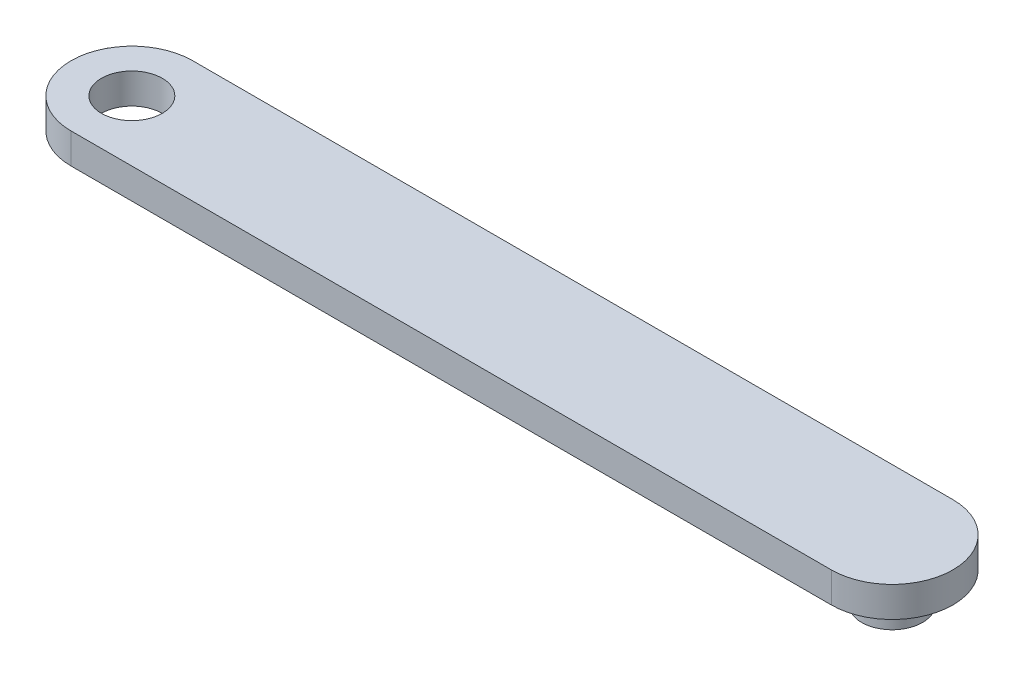
ISO-10303-21;
HEADER;
FILE_DESCRIPTION(('STEP AP214'),'2;1');
FILE_NAME('part.step','',(''),(''),'','','');
FILE_SCHEMA(('AUTOMOTIVE_DESIGN { 1 0 10303 214 1 1 1 1 }'));
ENDSEC;
DATA;
#1=APPLICATION_CONTEXT('core data for automotive mechanical design processes');
#2=APPLICATION_PROTOCOL_DEFINITION('international standard','automotive_design',2000,#1);
#3=PRODUCT_CONTEXT('',#1,'mechanical');
#4=PRODUCT('Part','Part','',(#3));
#5=PRODUCT_RELATED_PRODUCT_CATEGORY('part','',(#4));
#6=PRODUCT_DEFINITION_FORMATION('','',#4);
#7=PRODUCT_DEFINITION_CONTEXT('part definition',#1,'design');
#8=PRODUCT_DEFINITION('design','',#6,#7);
#9=PRODUCT_DEFINITION_SHAPE('','',#8);
#10=(LENGTH_UNIT() NAMED_UNIT(*) SI_UNIT(.MILLI.,.METRE.));
#11=(NAMED_UNIT(*) PLANE_ANGLE_UNIT() SI_UNIT($,.RADIAN.));
#12=(NAMED_UNIT(*) SI_UNIT($,.STERADIAN.) SOLID_ANGLE_UNIT());
#13=UNCERTAINTY_MEASURE_WITH_UNIT(LENGTH_MEASURE(1.E-05),#10,'distance_accuracy_value','');
#14=(GEOMETRIC_REPRESENTATION_CONTEXT(3) GLOBAL_UNCERTAINTY_ASSIGNED_CONTEXT((#13)) GLOBAL_UNIT_ASSIGNED_CONTEXT((#10,
#11,#12)) REPRESENTATION_CONTEXT('',''));
#15=CARTESIAN_POINT('',(0.,0.,0.));
#16=DIRECTION('',(0.,0.,1.));
#17=DIRECTION('',(1.,0.,0.));
#18=AXIS2_PLACEMENT_3D('',#15,#16,#17);
#19=CARTESIAN_POINT('',(0.,1.,2.));
#20=DIRECTION('',(0.,0.,-1.));
#21=DIRECTION('',(-1.,0.,0.));
#22=AXIS2_PLACEMENT_3D('',#19,#20,#21);
#23=PLANE('',#22);
#24=DIRECTION('',(1.,0.,0.));
#25=VECTOR('',#24,1.);
#26=CARTESIAN_POINT('',(0.,0.,2.));
#27=LINE('',#26,#25);
#28=CARTESIAN_POINT('',(-12.5,0.,2.));
#29=VERTEX_POINT('',#28);
#30=CARTESIAN_POINT('',(12.5,0.,2.));
#31=VERTEX_POINT('',#30);
#32=EDGE_CURVE('E116',#29,#31,#27,.T.);
#33=ORIENTED_EDGE('',*,*,#32,.T.);
#34=DIRECTION('',(0.,-1.,0.));
#35=VECTOR('',#34,1.);
#36=CARTESIAN_POINT('',(12.5,1.,2.));
#37=LINE('',#36,#35);
#38=CARTESIAN_POINT('',(12.5,1.,2.));
#39=VERTEX_POINT('',#38);
#40=EDGE_CURVE('E51',#39,#31,#37,.T.);
#41=ORIENTED_EDGE('',*,*,#40,.F.);
#42=DIRECTION('',(1.,0.,0.));
#43=VECTOR('',#42,1.);
#44=CARTESIAN_POINT('',(0.,1.,2.));
#45=LINE('',#44,#43);
#46=CARTESIAN_POINT('',(-12.5,1.,2.));
#47=VERTEX_POINT('',#46);
#48=EDGE_CURVE('E91',#47,#39,#45,.T.);
#49=ORIENTED_EDGE('',*,*,#48,.F.);
#50=DIRECTION('',(0.,-1.,0.));
#51=VECTOR('',#50,1.);
#52=CARTESIAN_POINT('',(-12.5,1.,2.));
#53=LINE('',#52,#51);
#54=EDGE_CURVE('E108',#47,#29,#53,.T.);
#55=ORIENTED_EDGE('',*,*,#54,.T.);
#56=EDGE_LOOP('',(#33,#41,#49,#55));
#57=FACE_BOUND('',#56,.T.);
#58=ADVANCED_FACE('F41',(#57),#23,.F.);
#59=CARTESIAN_POINT('',(12.5,1.,0.));
#60=DIRECTION('',(0.,-1.,0.));
#61=DIRECTION('',(0.,0.,-1.));
#62=AXIS2_PLACEMENT_3D('',#59,#60,#61);
#63=CYLINDRICAL_SURFACE('',#62,2.);
#64=CARTESIAN_POINT('',(12.5,0.,0.));
#65=DIRECTION('',(0.,1.,0.));
#66=DIRECTION('',(0.,0.,1.));
#67=AXIS2_PLACEMENT_3D('',#64,#65,#66);
#68=CIRCLE('',#67,2.);
#69=CARTESIAN_POINT('',(12.5,0.,-2.));
#70=VERTEX_POINT('',#69);
#71=EDGE_CURVE('E98',#31,#70,#68,.T.);
#72=ORIENTED_EDGE('',*,*,#71,.T.);
#73=DIRECTION('',(0.,-1.,0.));
#74=VECTOR('',#73,1.);
#75=CARTESIAN_POINT('',(12.5,1.,-2.));
#76=LINE('',#75,#74);
#77=CARTESIAN_POINT('',(12.5,1.,-2.));
#78=VERTEX_POINT('',#77);
#79=EDGE_CURVE('E96',#78,#70,#76,.T.);
#80=ORIENTED_EDGE('',*,*,#79,.F.);
#81=CARTESIAN_POINT('',(12.5,1.,0.));
#82=DIRECTION('',(0.,1.,0.));
#83=DIRECTION('',(0.,0.,1.));
#84=AXIS2_PLACEMENT_3D('',#81,#82,#83);
#85=CIRCLE('',#84,2.);
#86=EDGE_CURVE('E86',#39,#78,#85,.T.);
#87=ORIENTED_EDGE('',*,*,#86,.F.);
#88=ORIENTED_EDGE('',*,*,#40,.T.);
#89=EDGE_LOOP('',(#72,#80,#87,#88));
#90=FACE_BOUND('',#89,.T.);
#91=ADVANCED_FACE('F97',(#90),#63,.T.);
#92=CARTESIAN_POINT('',(0.,1.,-2.));
#93=DIRECTION('',(0.,0.,-1.));
#94=DIRECTION('',(-1.,0.,0.));
#95=AXIS2_PLACEMENT_3D('',#92,#93,#94);
#96=PLANE('',#95);
#97=DIRECTION('',(1.,0.,0.));
#98=VECTOR('',#97,1.);
#99=CARTESIAN_POINT('',(0.,0.,-2.));
#100=LINE('',#99,#98);
#101=CARTESIAN_POINT('',(-12.5,0.,-2.));
#102=VERTEX_POINT('',#101);
#103=EDGE_CURVE('E123',#102,#70,#100,.T.);
#104=ORIENTED_EDGE('',*,*,#103,.F.);
#105=DIRECTION('',(0.,-1.,0.));
#106=VECTOR('',#105,1.);
#107=CARTESIAN_POINT('',(-12.5,1.,-2.));
#108=LINE('',#107,#106);
#109=CARTESIAN_POINT('',(-12.5,1.,-2.));
#110=VERTEX_POINT('',#109);
#111=EDGE_CURVE('E75',#110,#102,#108,.T.);
#112=ORIENTED_EDGE('',*,*,#111,.F.);
#113=DIRECTION('',(1.,0.,0.));
#114=VECTOR('',#113,1.);
#115=CARTESIAN_POINT('',(0.,1.,-2.));
#116=LINE('',#115,#114);
#117=EDGE_CURVE('E89',#110,#78,#116,.T.);
#118=ORIENTED_EDGE('',*,*,#117,.T.);
#119=ORIENTED_EDGE('',*,*,#79,.T.);
#120=EDGE_LOOP('',(#104,#112,#118,#119));
#121=FACE_BOUND('',#120,.T.);
#122=ADVANCED_FACE('F104',(#121),#96,.T.);
#123=CARTESIAN_POINT('',(-12.5,1.,0.));
#124=DIRECTION('',(0.,-1.,0.));
#125=DIRECTION('',(0.,0.,-1.));
#126=AXIS2_PLACEMENT_3D('',#123,#124,#125);
#127=CYLINDRICAL_SURFACE('',#126,1.);
#128=CARTESIAN_POINT('',(-12.5,1.,0.));
#129=DIRECTION('',(0.,1.,0.));
#130=DIRECTION('',(0.,0.,1.));
#131=AXIS2_PLACEMENT_3D('',#128,#129,#130);
#132=CIRCLE('',#131,1.);
#133=CARTESIAN_POINT('',(-12.5,1.,1.));
#134=VERTEX_POINT('',#133);
#135=EDGE_CURVE('E128',#134,#134,#132,.T.);
#136=ORIENTED_EDGE('',*,*,#135,.T.);
#137=EDGE_LOOP('',(#136));
#138=FACE_BOUND('',#137,.T.);
#139=CARTESIAN_POINT('',(-12.5,0.,0.));
#140=DIRECTION('',(0.,1.,0.));
#141=DIRECTION('',(0.,0.,1.));
#142=AXIS2_PLACEMENT_3D('',#139,#140,#141);
#143=CIRCLE('',#142,1.);
#144=CARTESIAN_POINT('',(-12.5,0.,1.));
#145=VERTEX_POINT('',#144);
#146=EDGE_CURVE('E112',#145,#145,#143,.T.);
#147=ORIENTED_EDGE('',*,*,#146,.F.);
#148=EDGE_LOOP('',(#147));
#149=FACE_BOUND('',#148,.T.);
#150=ADVANCED_FACE('F43',(#138,#149),#127,.F.);
#151=CARTESIAN_POINT('',(-12.5,1.,0.));
#152=DIRECTION('',(0.,-1.,0.));
#153=DIRECTION('',(0.,0.,-1.));
#154=AXIS2_PLACEMENT_3D('',#151,#152,#153);
#155=CYLINDRICAL_SURFACE('',#154,2.);
#156=CARTESIAN_POINT('',(-12.5,0.,0.));
#157=DIRECTION('',(0.,1.,0.));
#158=DIRECTION('',(0.,0.,1.));
#159=AXIS2_PLACEMENT_3D('',#156,#157,#158);
#160=CIRCLE('',#159,2.);
#161=EDGE_CURVE('E78',#102,#29,#160,.T.);
#162=ORIENTED_EDGE('',*,*,#161,.T.);
#163=ORIENTED_EDGE('',*,*,#54,.F.);
#164=CARTESIAN_POINT('',(-12.5,1.,0.));
#165=DIRECTION('',(0.,1.,0.));
#166=DIRECTION('',(0.,0.,1.));
#167=AXIS2_PLACEMENT_3D('',#164,#165,#166);
#168=CIRCLE('',#167,2.);
#169=EDGE_CURVE('E59',#110,#47,#168,.T.);
#170=ORIENTED_EDGE('',*,*,#169,.F.);
#171=ORIENTED_EDGE('',*,*,#111,.T.);
#172=EDGE_LOOP('',(#162,#163,#170,#171));
#173=FACE_BOUND('',#172,.T.);
#174=ADVANCED_FACE('F148',(#173),#155,.T.);
#175=CARTESIAN_POINT('',(0.,1.,0.));
#176=DIRECTION('',(0.,1.,0.));
#177=DIRECTION('',(0.,0.,1.));
#178=AXIS2_PLACEMENT_3D('',#175,#176,#177);
#179=PLANE('',#178);
#180=ORIENTED_EDGE('',*,*,#135,.F.);
#181=EDGE_LOOP('',(#180));
#182=FACE_BOUND('',#181,.T.);
#183=ORIENTED_EDGE('',*,*,#48,.T.);
#184=ORIENTED_EDGE('',*,*,#86,.T.);
#185=ORIENTED_EDGE('',*,*,#117,.F.);
#186=ORIENTED_EDGE('',*,*,#169,.T.);
#187=EDGE_LOOP('',(#183,#184,#185,#186));
#188=FACE_BOUND('',#187,.T.);
#189=ADVANCED_FACE('F87',(#182,#188),#179,.T.);
#190=CARTESIAN_POINT('',(0.,0.,0.));
#191=DIRECTION('',(0.,1.,0.));
#192=DIRECTION('',(0.,0.,1.));
#193=AXIS2_PLACEMENT_3D('',#190,#191,#192);
#194=PLANE('',#193);
#195=CARTESIAN_POINT('',(12.5,0.,0.));
#196=DIRECTION('',(0.,1.,0.));
#197=DIRECTION('',(0.,0.,1.));
#198=AXIS2_PLACEMENT_3D('',#195,#196,#197);
#199=CIRCLE('',#198,1.);
#200=CARTESIAN_POINT('',(12.5,0.,1.));
#201=VERTEX_POINT('',#200);
#202=EDGE_CURVE('E11',#201,#201,#199,.F.);
#203=ORIENTED_EDGE('',*,*,#202,.F.);
#204=EDGE_LOOP('',(#203));
#205=FACE_BOUND('',#204,.T.);
#206=ORIENTED_EDGE('',*,*,#146,.T.);
#207=EDGE_LOOP('',(#206));
#208=FACE_BOUND('',#207,.T.);
#209=ORIENTED_EDGE('',*,*,#32,.F.);
#210=ORIENTED_EDGE('',*,*,#161,.F.);
#211=ORIENTED_EDGE('',*,*,#103,.T.);
#212=ORIENTED_EDGE('',*,*,#71,.F.);
#213=EDGE_LOOP('',(#209,#210,#211,#212));
#214=FACE_BOUND('',#213,.T.);
#215=ADVANCED_FACE('F136',(#205,#208,#214),#194,.F.);
#216=CARTESIAN_POINT('',(12.5,-1.,0.));
#217=DIRECTION('',(0.,1.,0.));
#218=DIRECTION('',(0.,0.,1.));
#219=AXIS2_PLACEMENT_3D('',#216,#217,#218);
#220=CYLINDRICAL_SURFACE('',#219,1.);
#221=CARTESIAN_POINT('',(12.5,-1.,0.));
#222=DIRECTION('',(0.,-1.,0.));
#223=DIRECTION('',(0.,0.,-1.));
#224=AXIS2_PLACEMENT_3D('',#221,#222,#223);
#225=CIRCLE('',#224,1.);
#226=CARTESIAN_POINT('',(12.5,-1.,-1.));
#227=VERTEX_POINT('',#226);
#228=EDGE_CURVE('E117',#227,#227,#225,.T.);
#229=ORIENTED_EDGE('',*,*,#228,.F.);
#230=EDGE_LOOP('',(#229));
#231=FACE_BOUND('',#230,.T.);
#232=ORIENTED_EDGE('',*,*,#202,.T.);
#233=EDGE_LOOP('',(#232));
#234=FACE_BOUND('',#233,.T.);
#235=ADVANCED_FACE('F138',(#231,#234),#220,.T.);
#236=CARTESIAN_POINT('',(12.5,-1.,0.));
#237=DIRECTION('',(0.,-1.,0.));
#238=DIRECTION('',(0.,0.,-1.));
#239=AXIS2_PLACEMENT_3D('',#236,#237,#238);
#240=PLANE('',#239);
#241=ORIENTED_EDGE('',*,*,#228,.T.);
#242=EDGE_LOOP('',(#241));
#243=FACE_BOUND('',#242,.T.);
#244=ADVANCED_FACE('F145',(#243),#240,.T.);
#245=CLOSED_SHELL('',(#58,#91,#122,#150,#174,#189,#215,#235,#244));
#246=MANIFOLD_SOLID_BREP('B2',#245);
#247=ADVANCED_BREP_SHAPE_REPRESENTATION('',(#18,#246),#14);
#248=SHAPE_DEFINITION_REPRESENTATION(#9,#247);
ENDSEC;
END-ISO-10303-21;
